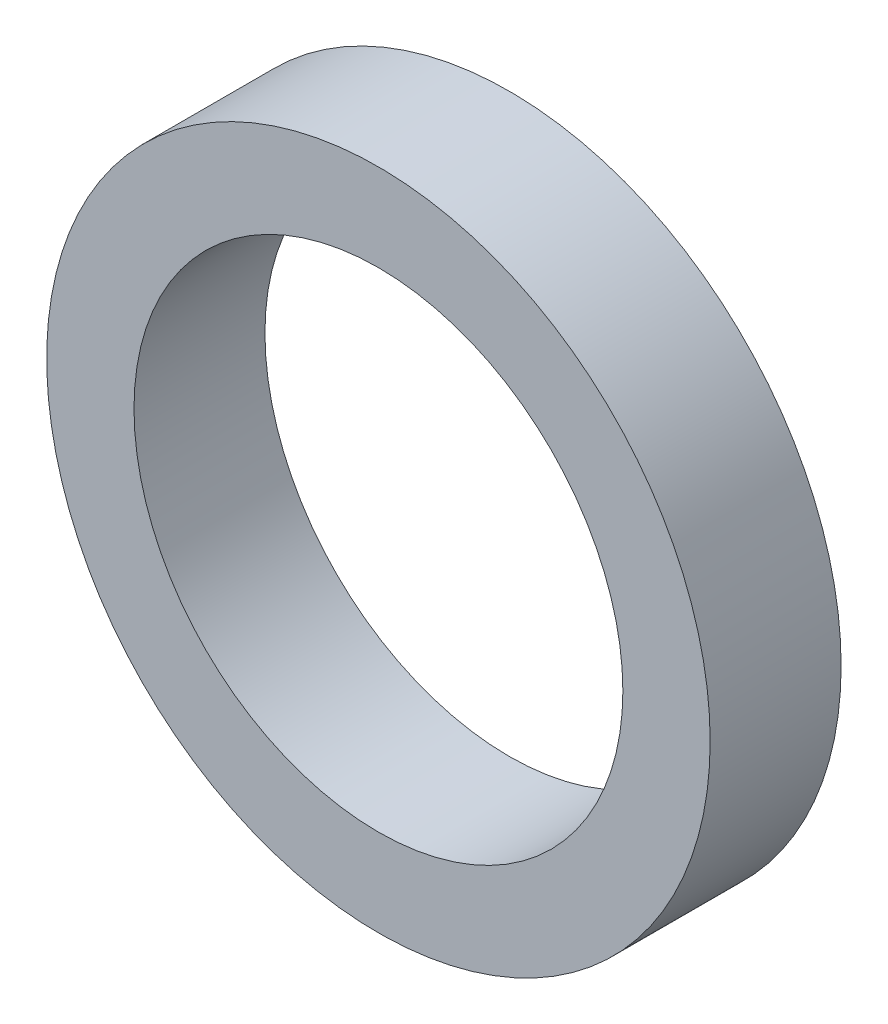
ISO-10303-21;
HEADER;
FILE_DESCRIPTION(('STEP AP214'),'2;1');
FILE_NAME('part.step','',(''),(''),'','','');
FILE_SCHEMA(('AUTOMOTIVE_DESIGN { 1 0 10303 214 1 1 1 1 }'));
ENDSEC;
DATA;
#1=APPLICATION_CONTEXT('core data for automotive mechanical design processes');
#2=APPLICATION_PROTOCOL_DEFINITION('international standard','automotive_design',2000,#1);
#3=PRODUCT_CONTEXT('',#1,'mechanical');
#4=PRODUCT('Part','Part','',(#3));
#5=PRODUCT_RELATED_PRODUCT_CATEGORY('part','',(#4));
#6=PRODUCT_DEFINITION_FORMATION('','',#4);
#7=PRODUCT_DEFINITION_CONTEXT('part definition',#1,'design');
#8=PRODUCT_DEFINITION('design','',#6,#7);
#9=PRODUCT_DEFINITION_SHAPE('','',#8);
#10=(LENGTH_UNIT() NAMED_UNIT(*) SI_UNIT(.MILLI.,.METRE.));
#11=(NAMED_UNIT(*) PLANE_ANGLE_UNIT() SI_UNIT($,.RADIAN.));
#12=(NAMED_UNIT(*) SI_UNIT($,.STERADIAN.) SOLID_ANGLE_UNIT());
#13=UNCERTAINTY_MEASURE_WITH_UNIT(LENGTH_MEASURE(1.E-05),#10,'distance_accuracy_value','');
#14=(GEOMETRIC_REPRESENTATION_CONTEXT(3) GLOBAL_UNCERTAINTY_ASSIGNED_CONTEXT((#13)) GLOBAL_UNIT_ASSIGNED_CONTEXT((#10,
#11,#12)) REPRESENTATION_CONTEXT('',''));
#15=CARTESIAN_POINT('',(0.,0.,0.));
#16=DIRECTION('',(0.,0.,1.));
#17=DIRECTION('',(1.,0.,0.));
#18=AXIS2_PLACEMENT_3D('',#15,#16,#17);
#19=CARTESIAN_POINT('',(0.,0.,1.905));
#20=DIRECTION('',(0.,0.,1.));
#21=DIRECTION('',(1.,0.,0.));
#22=AXIS2_PLACEMENT_3D('',#19,#20,#21);
#23=PLANE('',#22);
#24=CARTESIAN_POINT('',(0.,0.,1.905));
#25=DIRECTION('',(0.,0.,1.));
#26=DIRECTION('',(1.,0.,0.));
#27=AXIS2_PLACEMENT_3D('',#24,#25,#26);
#28=CIRCLE('',#27,4.826);
#29=CARTESIAN_POINT('',(4.826,0.,1.905));
#30=VERTEX_POINT('',#29);
#31=EDGE_CURVE('E10',#30,#30,#28,.T.);
#32=ORIENTED_EDGE('',*,*,#31,.T.);
#33=EDGE_LOOP('',(#32));
#34=FACE_BOUND('',#33,.T.);
#35=CARTESIAN_POINT('',(0.,0.,1.905));
#36=DIRECTION('',(0.,0.,1.));
#37=DIRECTION('',(1.,0.,0.));
#38=AXIS2_PLACEMENT_3D('',#35,#36,#37);
#39=CIRCLE('',#38,3.556);
#40=CARTESIAN_POINT('',(3.556,0.,1.905));
#41=VERTEX_POINT('',#40);
#42=EDGE_CURVE('E42',#41,#41,#39,.T.);
#43=ORIENTED_EDGE('',*,*,#42,.F.);
#44=EDGE_LOOP('',(#43));
#45=FACE_BOUND('',#44,.T.);
#46=ADVANCED_FACE('F31',(#34,#45),#23,.T.);
#47=CARTESIAN_POINT('',(0.,0.,0.));
#48=DIRECTION('',(0.,0.,1.));
#49=DIRECTION('',(1.,0.,0.));
#50=AXIS2_PLACEMENT_3D('',#47,#48,#49);
#51=PLANE('',#50);
#52=CARTESIAN_POINT('',(0.,0.,0.));
#53=DIRECTION('',(0.,0.,1.));
#54=DIRECTION('',(1.,0.,0.));
#55=AXIS2_PLACEMENT_3D('',#52,#53,#54);
#56=CIRCLE('',#55,4.826);
#57=CARTESIAN_POINT('',(4.826,0.,0.));
#58=VERTEX_POINT('',#57);
#59=EDGE_CURVE('E35',#58,#58,#56,.T.);
#60=ORIENTED_EDGE('',*,*,#59,.F.);
#61=EDGE_LOOP('',(#60));
#62=FACE_BOUND('',#61,.T.);
#63=CARTESIAN_POINT('',(0.,0.,0.));
#64=DIRECTION('',(0.,0.,1.));
#65=DIRECTION('',(1.,0.,0.));
#66=AXIS2_PLACEMENT_3D('',#63,#64,#65);
#67=CIRCLE('',#66,3.556);
#68=CARTESIAN_POINT('',(3.556,0.,0.));
#69=VERTEX_POINT('',#68);
#70=EDGE_CURVE('E44',#69,#69,#67,.T.);
#71=ORIENTED_EDGE('',*,*,#70,.T.);
#72=EDGE_LOOP('',(#71));
#73=FACE_BOUND('',#72,.T.);
#74=ADVANCED_FACE('F54',(#62,#73),#51,.F.);
#75=CARTESIAN_POINT('',(0.,0.,1.905));
#76=DIRECTION('',(0.,0.,-1.));
#77=DIRECTION('',(-1.,0.,0.));
#78=AXIS2_PLACEMENT_3D('',#75,#76,#77);
#79=CYLINDRICAL_SURFACE('',#78,4.826);
#80=ORIENTED_EDGE('',*,*,#31,.F.);
#81=EDGE_LOOP('',(#80));
#82=FACE_BOUND('',#81,.T.);
#83=ORIENTED_EDGE('',*,*,#59,.T.);
#84=EDGE_LOOP('',(#83));
#85=FACE_BOUND('',#84,.T.);
#86=ADVANCED_FACE('F33',(#82,#85),#79,.T.);
#87=CARTESIAN_POINT('',(0.,0.,1.905));
#88=DIRECTION('',(0.,0.,-1.));
#89=DIRECTION('',(-1.,0.,0.));
#90=AXIS2_PLACEMENT_3D('',#87,#88,#89);
#91=CYLINDRICAL_SURFACE('',#90,3.556);
#92=ORIENTED_EDGE('',*,*,#42,.T.);
#93=EDGE_LOOP('',(#92));
#94=FACE_BOUND('',#93,.T.);
#95=ORIENTED_EDGE('',*,*,#70,.F.);
#96=EDGE_LOOP('',(#95));
#97=FACE_BOUND('',#96,.T.);
#98=ADVANCED_FACE('F50',(#94,#97),#91,.F.);
#99=CLOSED_SHELL('',(#46,#74,#86,#98));
#100=MANIFOLD_SOLID_BREP('B2',#99);
#101=ADVANCED_BREP_SHAPE_REPRESENTATION('',(#18,#100),#14);
#102=SHAPE_DEFINITION_REPRESENTATION(#9,#101);
ENDSEC;
END-ISO-10303-21;
